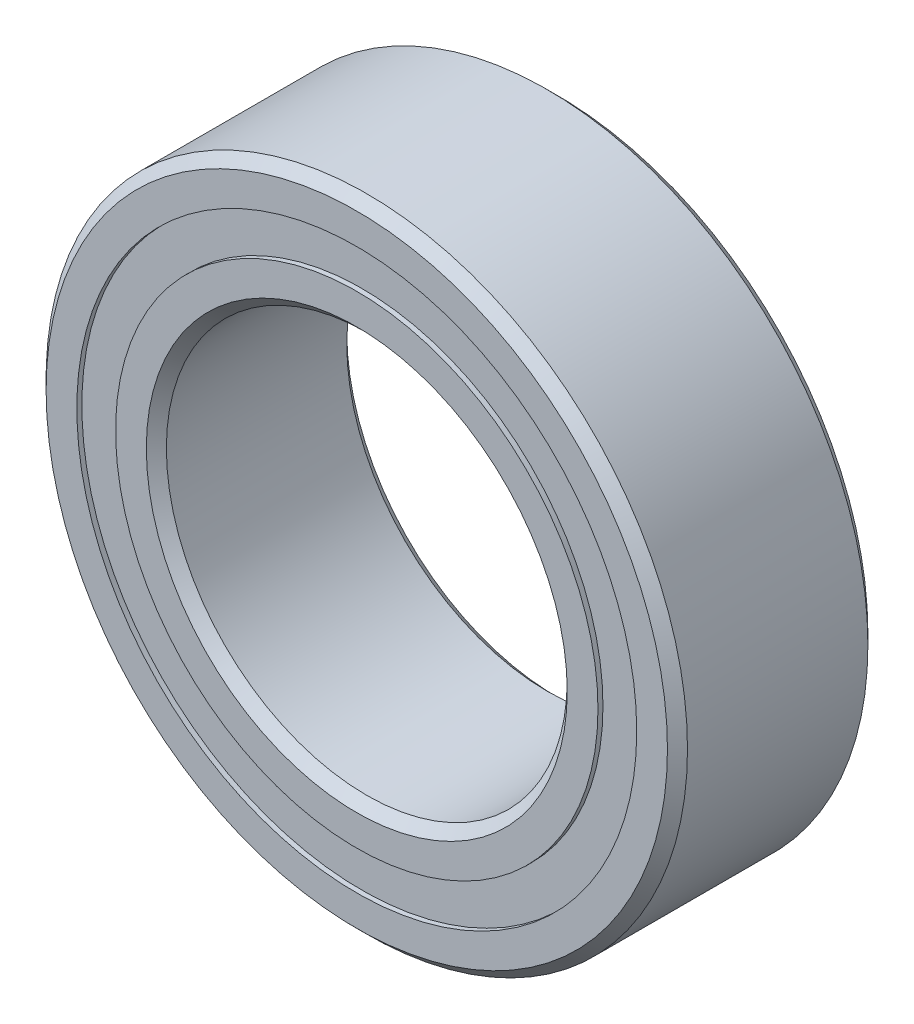
ISO-10303-21;
HEADER;
FILE_DESCRIPTION(('STEP AP214'),'2;1');
FILE_NAME('part.step','',(''),(''),'','','');
FILE_SCHEMA(('AUTOMOTIVE_DESIGN { 1 0 10303 214 1 1 1 1 }'));
ENDSEC;
DATA;
#1=APPLICATION_CONTEXT('core data for automotive mechanical design processes');
#2=APPLICATION_PROTOCOL_DEFINITION('international standard','automotive_design',2000,#1);
#3=PRODUCT_CONTEXT('',#1,'mechanical');
#4=PRODUCT('Part','Part','',(#3));
#5=PRODUCT_RELATED_PRODUCT_CATEGORY('part','',(#4));
#6=PRODUCT_DEFINITION_FORMATION('','',#4);
#7=PRODUCT_DEFINITION_CONTEXT('part definition',#1,'design');
#8=PRODUCT_DEFINITION('design','',#6,#7);
#9=PRODUCT_DEFINITION_SHAPE('','',#8);
#10=(LENGTH_UNIT() NAMED_UNIT(*) SI_UNIT(.MILLI.,.METRE.));
#11=(NAMED_UNIT(*) PLANE_ANGLE_UNIT() SI_UNIT($,.RADIAN.));
#12=(NAMED_UNIT(*) SI_UNIT($,.STERADIAN.) SOLID_ANGLE_UNIT());
#13=UNCERTAINTY_MEASURE_WITH_UNIT(LENGTH_MEASURE(1.E-05),#10,'distance_accuracy_value','');
#14=(GEOMETRIC_REPRESENTATION_CONTEXT(3) GLOBAL_UNCERTAINTY_ASSIGNED_CONTEXT((#13)) GLOBAL_UNIT_ASSIGNED_CONTEXT((#10,
#11,#12)) REPRESENTATION_CONTEXT('',''));
#15=CARTESIAN_POINT('',(0.,0.,0.));
#16=DIRECTION('',(0.,0.,1.));
#17=DIRECTION('',(1.,0.,0.));
#18=AXIS2_PLACEMENT_3D('',#15,#16,#17);
#19=CARTESIAN_POINT('',(0.,3.49175824175824,-1.1875));
#20=DIRECTION('',(0.,0.,1.));
#21=DIRECTION('',(1.,0.,0.));
#22=AXIS2_PLACEMENT_3D('',#19,#20,#21);
#23=PLANE('',#22);
#24=CARTESIAN_POINT('',(0.,0.,-1.1875));
#25=DIRECTION('',(0.,0.,1.));
#26=DIRECTION('',(1.,0.,0.));
#27=AXIS2_PLACEMENT_3D('',#24,#25,#26);
#28=CIRCLE('',#27,3.49175824175824);
#29=CARTESIAN_POINT('',(3.49175824175824,0.,-1.1875));
#30=VERTEX_POINT('',#29);
#31=EDGE_CURVE('E66',#30,#30,#28,.T.);
#32=ORIENTED_EDGE('',*,*,#31,.F.);
#33=EDGE_LOOP('',(#32));
#34=FACE_BOUND('',#33,.T.);
#35=CARTESIAN_POINT('',(0.,0.,-1.1875));
#36=DIRECTION('',(0.,0.,1.));
#37=DIRECTION('',(1.,0.,0.));
#38=AXIS2_PLACEMENT_3D('',#35,#36,#37);
#39=CIRCLE('',#38,3.00824175824176);
#40=CARTESIAN_POINT('',(3.00824175824176,0.,-1.1875));
#41=VERTEX_POINT('',#40);
#42=EDGE_CURVE('E11',#41,#41,#39,.T.);
#43=ORIENTED_EDGE('',*,*,#42,.T.);
#44=EDGE_LOOP('',(#43));
#45=FACE_BOUND('',#44,.T.);
#46=ADVANCED_FACE('F52',(#34,#45),#23,.F.);
#47=CARTESIAN_POINT('',(0.,0.,1.25));
#48=DIRECTION('',(0.,0.,1.));
#49=DIRECTION('',(1.,0.,0.));
#50=AXIS2_PLACEMENT_3D('',#47,#48,#49);
#51=CYLINDRICAL_SURFACE('',#50,3.00824175824176);
#52=ORIENTED_EDGE('',*,*,#42,.F.);
#53=EDGE_LOOP('',(#52));
#54=FACE_BOUND('',#53,.T.);
#55=CARTESIAN_POINT('',(0.,0.,-0.605878719519575));
#56=DIRECTION('',(0.,0.,1.));
#57=DIRECTION('',(1.,0.,0.));
#58=AXIS2_PLACEMENT_3D('',#55,#56,#57);
#59=CIRCLE('',#58,3.00824175824176);
#60=CARTESIAN_POINT('',(3.00824175824176,0.,-0.605878719519575));
#61=VERTEX_POINT('',#60);
#62=EDGE_CURVE('E58',#61,#61,#59,.T.);
#63=ORIENTED_EDGE('',*,*,#62,.T.);
#64=EDGE_LOOP('',(#63));
#65=FACE_BOUND('',#64,.T.);
#66=ADVANCED_FACE('F75',(#54,#65),#51,.F.);
#67=CARTESIAN_POINT('',(0.,3.49175824175824,-0.605878719519575));
#68=DIRECTION('',(0.,0.,-1.));
#69=DIRECTION('',(-1.,0.,0.));
#70=AXIS2_PLACEMENT_3D('',#67,#68,#69);
#71=PLANE('',#70);
#72=ORIENTED_EDGE('',*,*,#62,.F.);
#73=EDGE_LOOP('',(#72));
#74=FACE_BOUND('',#73,.T.);
#75=CARTESIAN_POINT('',(0.,0.,-0.605878719519575));
#76=DIRECTION('',(0.,0.,1.));
#77=DIRECTION('',(1.,0.,0.));
#78=AXIS2_PLACEMENT_3D('',#75,#76,#77);
#79=CIRCLE('',#78,3.49175824175824);
#80=CARTESIAN_POINT('',(3.49175824175824,0.,-0.605878719519575));
#81=VERTEX_POINT('',#80);
#82=EDGE_CURVE('E62',#81,#81,#79,.T.);
#83=ORIENTED_EDGE('',*,*,#82,.T.);
#84=EDGE_LOOP('',(#83));
#85=FACE_BOUND('',#84,.T.);
#86=ADVANCED_FACE('F79',(#74,#85),#71,.F.);
#87=CARTESIAN_POINT('',(0.,0.,1.25));
#88=DIRECTION('',(0.,0.,1.));
#89=DIRECTION('',(1.,0.,0.));
#90=AXIS2_PLACEMENT_3D('',#87,#88,#89);
#91=CYLINDRICAL_SURFACE('',#90,3.49175824175824);
#92=ORIENTED_EDGE('',*,*,#82,.F.);
#93=EDGE_LOOP('',(#92));
#94=FACE_BOUND('',#93,.T.);
#95=ORIENTED_EDGE('',*,*,#31,.T.);
#96=EDGE_LOOP('',(#95));
#97=FACE_BOUND('',#96,.T.);
#98=ADVANCED_FACE('F72',(#94,#97),#91,.T.);
#99=CLOSED_SHELL('',(#46,#66,#86,#98));
#100=MANIFOLD_SOLID_BREP('B2',#99);
#101=CARTESIAN_POINT('',(0.,3.49175824175824,1.1875));
#102=DIRECTION('',(0.,0.,-1.));
#103=DIRECTION('',(-1.,0.,0.));
#104=AXIS2_PLACEMENT_3D('',#101,#102,#103);
#105=PLANE('',#104);
#106=CARTESIAN_POINT('',(0.,0.,1.1875));
#107=DIRECTION('',(0.,0.,1.));
#108=DIRECTION('',(1.,0.,0.));
#109=AXIS2_PLACEMENT_3D('',#106,#107,#108);
#110=CIRCLE('',#109,3.00824175824176);
#111=CARTESIAN_POINT('',(3.00824175824176,0.,1.1875));
#112=VERTEX_POINT('',#111);
#113=EDGE_CURVE('E51',#112,#112,#110,.T.);
#114=ORIENTED_EDGE('',*,*,#113,.F.);
#115=EDGE_LOOP('',(#114));
#116=FACE_BOUND('',#115,.T.);
#117=CARTESIAN_POINT('',(0.,0.,1.1875));
#118=DIRECTION('',(0.,0.,1.));
#119=DIRECTION('',(1.,0.,0.));
#120=AXIS2_PLACEMENT_3D('',#117,#118,#119);
#121=CIRCLE('',#120,3.49175824175824);
#122=CARTESIAN_POINT('',(3.49175824175824,0.,1.1875));
#123=VERTEX_POINT('',#122);
#124=EDGE_CURVE('E126',#123,#123,#121,.T.);
#125=ORIENTED_EDGE('',*,*,#124,.T.);
#126=EDGE_LOOP('',(#125));
#127=FACE_BOUND('',#126,.T.);
#128=ADVANCED_FACE('F112',(#116,#127),#105,.F.);
#129=CARTESIAN_POINT('',(0.,0.,1.25));
#130=DIRECTION('',(0.,0.,1.));
#131=DIRECTION('',(1.,0.,0.));
#132=AXIS2_PLACEMENT_3D('',#129,#130,#131);
#133=CYLINDRICAL_SURFACE('',#132,3.00824175824176);
#134=CARTESIAN_POINT('',(0.,0.,0.605878719519573));
#135=DIRECTION('',(0.,0.,1.));
#136=DIRECTION('',(1.,0.,0.));
#137=AXIS2_PLACEMENT_3D('',#134,#135,#136);
#138=CIRCLE('',#137,3.00824175824176);
#139=CARTESIAN_POINT('',(3.00824175824176,0.,0.605878719519573));
#140=VERTEX_POINT('',#139);
#141=EDGE_CURVE('E118',#140,#140,#138,.T.);
#142=ORIENTED_EDGE('',*,*,#141,.F.);
#143=EDGE_LOOP('',(#142));
#144=FACE_BOUND('',#143,.T.);
#145=ORIENTED_EDGE('',*,*,#113,.T.);
#146=EDGE_LOOP('',(#145));
#147=FACE_BOUND('',#146,.T.);
#148=ADVANCED_FACE('F141',(#144,#147),#133,.F.);
#149=CARTESIAN_POINT('',(0.,3.49175824175824,0.605878719519573));
#150=DIRECTION('',(0.,0.,1.));
#151=DIRECTION('',(1.,0.,0.));
#152=AXIS2_PLACEMENT_3D('',#149,#150,#151);
#153=PLANE('',#152);
#154=CARTESIAN_POINT('',(0.,0.,0.605878719519573));
#155=DIRECTION('',(0.,0.,1.));
#156=DIRECTION('',(1.,0.,0.));
#157=AXIS2_PLACEMENT_3D('',#154,#155,#156);
#158=CIRCLE('',#157,3.49175824175824);
#159=CARTESIAN_POINT('',(3.49175824175824,0.,0.605878719519573));
#160=VERTEX_POINT('',#159);
#161=EDGE_CURVE('E122',#160,#160,#158,.T.);
#162=ORIENTED_EDGE('',*,*,#161,.F.);
#163=EDGE_LOOP('',(#162));
#164=FACE_BOUND('',#163,.T.);
#165=ORIENTED_EDGE('',*,*,#141,.T.);
#166=EDGE_LOOP('',(#165));
#167=FACE_BOUND('',#166,.T.);
#168=ADVANCED_FACE('F136',(#164,#167),#153,.F.);
#169=CARTESIAN_POINT('',(0.,0.,1.25));
#170=DIRECTION('',(0.,0.,1.));
#171=DIRECTION('',(1.,0.,0.));
#172=AXIS2_PLACEMENT_3D('',#169,#170,#171);
#173=CYLINDRICAL_SURFACE('',#172,3.49175824175824);
#174=ORIENTED_EDGE('',*,*,#124,.F.);
#175=EDGE_LOOP('',(#174));
#176=FACE_BOUND('',#175,.T.);
#177=ORIENTED_EDGE('',*,*,#161,.T.);
#178=EDGE_LOOP('',(#177));
#179=FACE_BOUND('',#178,.T.);
#180=ADVANCED_FACE('F133',(#176,#179),#173,.T.);
#181=CLOSED_SHELL('',(#128,#148,#168,#180));
#182=MANIFOLD_SOLID_BREP('B6',#181);
#183=CARTESIAN_POINT('',(-1.62499999999996,2.81458256229945,0.));
#184=DIRECTION('',(0.,0.,1.));
#185=DIRECTION('',(-0.499999999999989,0.866025403784445,0.));
#186=AXIS2_PLACEMENT_3D('',#183,#184,#185);
#187=SPHERICAL_SURFACE('',#186,0.605878719519574);
#188=CARTESIAN_POINT('',(-1.62499999999996,2.81458256229945,0.605878719519573));
#189=VERTEX_POINT('',#188);
#190=VERTEX_LOOP('',#189);
#191=FACE_BOUND('',#190,.T.);
#192=ADVANCED_FACE('F172',(#191),#187,.T.);
#193=CLOSED_SHELL('',(#192));
#194=MANIFOLD_SOLID_BREP('B46',#193);
#195=CARTESIAN_POINT('',(-2.81458256229941,1.62500000000003,0.));
#196=DIRECTION('',(0.,0.,1.));
#197=DIRECTION('',(-0.866025403784433,0.50000000000001,0.));
#198=AXIS2_PLACEMENT_3D('',#195,#196,#197);
#199=SPHERICAL_SURFACE('',#198,0.605878719519574);
#200=CARTESIAN_POINT('',(-2.81458256229941,1.62500000000003,0.605878719519573));
#201=VERTEX_POINT('',#200);
#202=VERTEX_LOOP('',#201);
#203=FACE_BOUND('',#202,.T.);
#204=ADVANCED_FACE('F195',(#203),#199,.T.);
#205=CLOSED_SHELL('',(#204));
#206=MANIFOLD_SOLID_BREP('B108',#205);
#207=CARTESIAN_POINT('',(-3.25,0.,0.));
#208=DIRECTION('',(0.,0.,1.));
#209=DIRECTION('',(-1.,0.,0.));
#210=AXIS2_PLACEMENT_3D('',#207,#208,#209);
#211=SPHERICAL_SURFACE('',#210,0.605878719519574);
#212=CARTESIAN_POINT('',(-3.25,0.,0.605878719519573));
#213=VERTEX_POINT('',#212);
#214=VERTEX_LOOP('',#213);
#215=FACE_BOUND('',#214,.T.);
#216=ADVANCED_FACE('F218',(#215),#211,.T.);
#217=CLOSED_SHELL('',(#216));
#218=MANIFOLD_SOLID_BREP('B168',#217);
#219=CARTESIAN_POINT('',(-2.81458256229944,-1.62499999999997,0.));
#220=DIRECTION('',(0.,0.,1.));
#221=DIRECTION('',(-0.866025403784443,-0.499999999999992,0.));
#222=AXIS2_PLACEMENT_3D('',#219,#220,#221);
#223=SPHERICAL_SURFACE('',#222,0.605878719519574);
#224=CARTESIAN_POINT('',(-2.81458256229944,-1.62499999999997,0.605878719519573));
#225=VERTEX_POINT('',#224);
#226=VERTEX_LOOP('',#225);
#227=FACE_BOUND('',#226,.T.);
#228=ADVANCED_FACE('F241',(#227),#223,.T.);
#229=CLOSED_SHELL('',(#228));
#230=MANIFOLD_SOLID_BREP('B191',#229);
#231=CARTESIAN_POINT('',(-1.62500000000002,-2.81458256229941,0.));
#232=DIRECTION('',(0.,0.,1.));
#233=DIRECTION('',(-0.500000000000007,-0.866025403784435,0.));
#234=AXIS2_PLACEMENT_3D('',#231,#232,#233);
#235=SPHERICAL_SURFACE('',#234,0.605878719519574);
#236=CARTESIAN_POINT('',(-1.62500000000002,-2.81458256229941,0.605878719519573));
#237=VERTEX_POINT('',#236);
#238=VERTEX_LOOP('',#237);
#239=FACE_BOUND('',#238,.T.);
#240=ADVANCED_FACE('F264',(#239),#235,.T.);
#241=CLOSED_SHELL('',(#240));
#242=MANIFOLD_SOLID_BREP('B214',#241);
#243=CARTESIAN_POINT('',(0.,-3.25,0.));
#244=DIRECTION('',(0.,0.,1.));
#245=DIRECTION('',(0.,-1.,0.));
#246=AXIS2_PLACEMENT_3D('',#243,#244,#245);
#247=SPHERICAL_SURFACE('',#246,0.605878719519574);
#248=CARTESIAN_POINT('',(0.,-3.25,0.605878719519573));
#249=VERTEX_POINT('',#248);
#250=VERTEX_LOOP('',#249);
#251=FACE_BOUND('',#250,.T.);
#252=ADVANCED_FACE('F287',(#251),#247,.T.);
#253=CLOSED_SHELL('',(#252));
#254=MANIFOLD_SOLID_BREP('B237',#253);
#255=CARTESIAN_POINT('',(1.62499999999998,-2.81458256229944,0.));
#256=DIRECTION('',(0.,0.,1.));
#257=DIRECTION('',(0.499999999999995,-0.866025403784442,0.));
#258=AXIS2_PLACEMENT_3D('',#255,#256,#257);
#259=SPHERICAL_SURFACE('',#258,0.605878719519574);
#260=CARTESIAN_POINT('',(1.62499999999998,-2.81458256229944,0.605878719519573));
#261=VERTEX_POINT('',#260);
#262=VERTEX_LOOP('',#261);
#263=FACE_BOUND('',#262,.T.);
#264=ADVANCED_FACE('F310',(#263),#259,.T.);
#265=CLOSED_SHELL('',(#264));
#266=MANIFOLD_SOLID_BREP('B260',#265);
#267=CARTESIAN_POINT('',(2.81458256229942,-1.62500000000001,0.));
#268=DIRECTION('',(0.,0.,1.));
#269=DIRECTION('',(0.866025403784436,-0.500000000000004,0.));
#270=AXIS2_PLACEMENT_3D('',#267,#268,#269);
#271=SPHERICAL_SURFACE('',#270,0.605878719519574);
#272=CARTESIAN_POINT('',(2.81458256229942,-1.62500000000001,0.605878719519573));
#273=VERTEX_POINT('',#272);
#274=VERTEX_LOOP('',#273);
#275=FACE_BOUND('',#274,.T.);
#276=ADVANCED_FACE('F333',(#275),#271,.T.);
#277=CLOSED_SHELL('',(#276));
#278=MANIFOLD_SOLID_BREP('B283',#277);
#279=CARTESIAN_POINT('',(3.25,0.,0.));
#280=DIRECTION('',(0.,0.,1.));
#281=DIRECTION('',(1.,0.,0.));
#282=AXIS2_PLACEMENT_3D('',#279,#280,#281);
#283=SPHERICAL_SURFACE('',#282,0.605878719519574);
#284=CARTESIAN_POINT('',(3.25,0.,0.605878719519573));
#285=VERTEX_POINT('',#284);
#286=VERTEX_LOOP('',#285);
#287=FACE_BOUND('',#286,.T.);
#288=ADVANCED_FACE('F356',(#287),#283,.T.);
#289=CLOSED_SHELL('',(#288));
#290=MANIFOLD_SOLID_BREP('B306',#289);
#291=CARTESIAN_POINT('',(2.81458256229943,1.62499999999999,0.));
#292=DIRECTION('',(0.,0.,1.));
#293=DIRECTION('',(0.86602540378444,0.499999999999998,0.));
#294=AXIS2_PLACEMENT_3D('',#291,#292,#293);
#295=SPHERICAL_SURFACE('',#294,0.605878719519574);
#296=CARTESIAN_POINT('',(2.81458256229943,1.62499999999999,0.605878719519573));
#297=VERTEX_POINT('',#296);
#298=VERTEX_LOOP('',#297);
#299=FACE_BOUND('',#298,.T.);
#300=ADVANCED_FACE('F379',(#299),#295,.T.);
#301=CLOSED_SHELL('',(#300));
#302=MANIFOLD_SOLID_BREP('B329',#301);
#303=CARTESIAN_POINT('',(1.625,2.81458256229942,0.));
#304=DIRECTION('',(0.,0.,1.));
#305=DIRECTION('',(0.500000000000001,0.866025403784438,0.));
#306=AXIS2_PLACEMENT_3D('',#303,#304,#305);
#307=SPHERICAL_SURFACE('',#306,0.605878719519574);
#308=CARTESIAN_POINT('',(1.625,2.81458256229942,0.605878719519573));
#309=VERTEX_POINT('',#308);
#310=VERTEX_LOOP('',#309);
#311=FACE_BOUND('',#310,.T.);
#312=ADVANCED_FACE('F402',(#311),#307,.T.);
#313=CLOSED_SHELL('',(#312));
#314=MANIFOLD_SOLID_BREP('B352',#313);
#315=CARTESIAN_POINT('',(0.,3.25,0.));
#316=DIRECTION('',(0.,0.,1.));
#317=DIRECTION('',(0.,1.,0.));
#318=AXIS2_PLACEMENT_3D('',#315,#316,#317);
#319=SPHERICAL_SURFACE('',#318,0.605878719519574);
#320=CARTESIAN_POINT('',(0.,3.25,0.605878719519573));
#321=VERTEX_POINT('',#320);
#322=VERTEX_LOOP('',#321);
#323=FACE_BOUND('',#322,.T.);
#324=ADVANCED_FACE('F427',(#323),#319,.T.);
#325=CLOSED_SHELL('',(#324));
#326=MANIFOLD_SOLID_BREP('B375',#325);
#327=CARTESIAN_POINT('',(0.,3.00824175824176,1.25));
#328=DIRECTION('',(0.,0.,-1.));
#329=DIRECTION('',(-1.,0.,0.));
#330=AXIS2_PLACEMENT_3D('',#327,#328,#329);
#331=PLANE('',#330);
#332=CARTESIAN_POINT('',(0.,0.,1.25));
#333=DIRECTION('',(0.,0.,1.));
#334=DIRECTION('',(1.,0.,0.));
#335=AXIS2_PLACEMENT_3D('',#332,#333,#334);
#336=CIRCLE('',#335,2.625);
#337=CARTESIAN_POINT('',(2.625,0.,1.25));
#338=VERTEX_POINT('',#337);
#339=EDGE_CURVE('E473',#338,#338,#336,.T.);
#340=ORIENTED_EDGE('',*,*,#339,.F.);
#341=EDGE_LOOP('',(#340));
#342=FACE_BOUND('',#341,.T.);
#343=CARTESIAN_POINT('',(0.,0.,1.25));
#344=DIRECTION('',(0.,0.,1.));
#345=DIRECTION('',(1.,0.,0.));
#346=AXIS2_PLACEMENT_3D('',#343,#344,#345);
#347=CIRCLE('',#346,3.00824175824176);
#348=CARTESIAN_POINT('',(3.00824175824176,0.,1.25));
#349=VERTEX_POINT('',#348);
#350=EDGE_CURVE('E426',#349,#349,#347,.T.);
#351=ORIENTED_EDGE('',*,*,#350,.T.);
#352=EDGE_LOOP('',(#351));
#353=FACE_BOUND('',#352,.T.);
#354=ADVANCED_FACE('F445',(#342,#353),#331,.F.);
#355=CARTESIAN_POINT('',(0.,0.,1.25));
#356=DIRECTION('',(0.,0.,1.));
#357=DIRECTION('',(1.,0.,0.));
#358=AXIS2_PLACEMENT_3D('',#355,#356,#357);
#359=CYLINDRICAL_SURFACE('',#358,3.00824175824176);
#360=ORIENTED_EDGE('',*,*,#350,.F.);
#361=EDGE_LOOP('',(#360));
#362=FACE_BOUND('',#361,.T.);
#363=CARTESIAN_POINT('',(0.,0.,0.555555555555555));
#364=DIRECTION('',(0.,0.,1.));
#365=DIRECTION('',(1.,0.,0.));
#366=AXIS2_PLACEMENT_3D('',#363,#364,#365);
#367=CIRCLE('',#366,3.00824175824176);
#368=CARTESIAN_POINT('',(3.00824175824176,0.,0.555555555555555));
#369=VERTEX_POINT('',#368);
#370=EDGE_CURVE('E451',#369,#369,#367,.T.);
#371=ORIENTED_EDGE('',*,*,#370,.T.);
#372=EDGE_LOOP('',(#371));
#373=FACE_BOUND('',#372,.T.);
#374=ADVANCED_FACE('F480',(#362,#373),#359,.T.);
#375=CARTESIAN_POINT('',(0.,0.,0.));
#376=DIRECTION('',(0.,0.,1.));
#377=DIRECTION('',(1.,0.,0.));
#378=AXIS2_PLACEMENT_3D('',#375,#376,#377);
#379=TOROIDAL_SURFACE('',#378,3.25,0.605878719519573);
#380=ORIENTED_EDGE('',*,*,#370,.F.);
#381=EDGE_LOOP('',(#380));
#382=FACE_BOUND('',#381,.T.);
#383=CARTESIAN_POINT('',(0.,0.,-0.555555555555557));
#384=DIRECTION('',(0.,0.,1.));
#385=DIRECTION('',(1.,0.,0.));
#386=AXIS2_PLACEMENT_3D('',#383,#384,#385);
#387=CIRCLE('',#386,3.00824175824176);
#388=CARTESIAN_POINT('',(3.00824175824176,0.,-0.555555555555557));
#389=VERTEX_POINT('',#388);
#390=EDGE_CURVE('E455',#389,#389,#387,.T.);
#391=ORIENTED_EDGE('',*,*,#390,.T.);
#392=EDGE_LOOP('',(#391));
#393=FACE_BOUND('',#392,.T.);
#394=ADVANCED_FACE('F484',(#382,#393),#379,.F.);
#395=CARTESIAN_POINT('',(0.,0.,1.25));
#396=DIRECTION('',(0.,0.,1.));
#397=DIRECTION('',(1.,0.,0.));
#398=AXIS2_PLACEMENT_3D('',#395,#396,#397);
#399=CYLINDRICAL_SURFACE('',#398,3.00824175824176);
#400=ORIENTED_EDGE('',*,*,#390,.F.);
#401=EDGE_LOOP('',(#400));
#402=FACE_BOUND('',#401,.T.);
#403=CARTESIAN_POINT('',(0.,0.,-1.25));
#404=DIRECTION('',(0.,0.,1.));
#405=DIRECTION('',(1.,0.,0.));
#406=AXIS2_PLACEMENT_3D('',#403,#404,#405);
#407=CIRCLE('',#406,3.00824175824176);
#408=CARTESIAN_POINT('',(3.00824175824176,0.,-1.25));
#409=VERTEX_POINT('',#408);
#410=EDGE_CURVE('E459',#409,#409,#407,.T.);
#411=ORIENTED_EDGE('',*,*,#410,.T.);
#412=EDGE_LOOP('',(#411));
#413=FACE_BOUND('',#412,.T.);
#414=ADVANCED_FACE('F489',(#402,#413),#399,.T.);
#415=CARTESIAN_POINT('',(0.,2.625,-1.25));
#416=DIRECTION('',(0.,0.,1.));
#417=DIRECTION('',(1.,0.,0.));
#418=AXIS2_PLACEMENT_3D('',#415,#416,#417);
#419=PLANE('',#418);
#420=ORIENTED_EDGE('',*,*,#410,.F.);
#421=EDGE_LOOP('',(#420));
#422=FACE_BOUND('',#421,.T.);
#423=CARTESIAN_POINT('',(0.,0.,-1.25));
#424=DIRECTION('',(0.,0.,1.));
#425=DIRECTION('',(1.,0.,0.));
#426=AXIS2_PLACEMENT_3D('',#423,#424,#425);
#427=CIRCLE('',#426,2.625);
#428=CARTESIAN_POINT('',(2.625,0.,-1.25));
#429=VERTEX_POINT('',#428);
#430=EDGE_CURVE('E464',#429,#429,#427,.T.);
#431=ORIENTED_EDGE('',*,*,#430,.T.);
#432=EDGE_LOOP('',(#431));
#433=FACE_BOUND('',#432,.T.);
#434=ADVANCED_FACE('F495',(#422,#433),#419,.F.);
#435=CARTESIAN_POINT('',(0.,0.,-1.125));
#436=DIRECTION('',(0.,0.,-1.));
#437=DIRECTION('',(-1.,0.,0.));
#438=AXIS2_PLACEMENT_3D('',#435,#436,#437);
#439=CONICAL_SURFACE('',#438,2.5,0.78539816339745);
#440=ORIENTED_EDGE('',*,*,#430,.F.);
#441=EDGE_LOOP('',(#440));
#442=FACE_BOUND('',#441,.T.);
#443=CARTESIAN_POINT('',(0.,0.,-1.125));
#444=DIRECTION('',(0.,0.,1.));
#445=DIRECTION('',(1.,0.,0.));
#446=AXIS2_PLACEMENT_3D('',#443,#444,#445);
#447=CIRCLE('',#446,2.5);
#448=CARTESIAN_POINT('',(2.5,0.,-1.125));
#449=VERTEX_POINT('',#448);
#450=EDGE_CURVE('E467',#449,#449,#447,.T.);
#451=ORIENTED_EDGE('',*,*,#450,.T.);
#452=EDGE_LOOP('',(#451));
#453=FACE_BOUND('',#452,.T.);
#454=ADVANCED_FACE('F499',(#442,#453),#439,.F.);
#455=CARTESIAN_POINT('',(0.,0.,1.25));
#456=DIRECTION('',(0.,0.,1.));
#457=DIRECTION('',(1.,0.,0.));
#458=AXIS2_PLACEMENT_3D('',#455,#456,#457);
#459=CYLINDRICAL_SURFACE('',#458,2.5);
#460=ORIENTED_EDGE('',*,*,#450,.F.);
#461=EDGE_LOOP('',(#460));
#462=FACE_BOUND('',#461,.T.);
#463=CARTESIAN_POINT('',(0.,0.,1.125));
#464=DIRECTION('',(0.,0.,1.));
#465=DIRECTION('',(1.,0.,0.));
#466=AXIS2_PLACEMENT_3D('',#463,#464,#465);
#467=CIRCLE('',#466,2.5);
#468=CARTESIAN_POINT('',(2.5,0.,1.125));
#469=VERTEX_POINT('',#468);
#470=EDGE_CURVE('E470',#469,#469,#467,.T.);
#471=ORIENTED_EDGE('',*,*,#470,.T.);
#472=EDGE_LOOP('',(#471));
#473=FACE_BOUND('',#472,.T.);
#474=ADVANCED_FACE('F503',(#462,#473),#459,.F.);
#475=CARTESIAN_POINT('',(0.,0.,1.25));
#476=DIRECTION('',(0.,0.,1.));
#477=DIRECTION('',(1.,0.,0.));
#478=AXIS2_PLACEMENT_3D('',#475,#476,#477);
#479=CONICAL_SURFACE('',#478,2.625,0.785398163397447);
#480=ORIENTED_EDGE('',*,*,#470,.F.);
#481=EDGE_LOOP('',(#480));
#482=FACE_BOUND('',#481,.T.);
#483=ORIENTED_EDGE('',*,*,#339,.T.);
#484=EDGE_LOOP('',(#483));
#485=FACE_BOUND('',#484,.T.);
#486=ADVANCED_FACE('F477',(#482,#485),#479,.F.);
#487=CLOSED_SHELL('',(#354,#374,#394,#414,#434,#454,#474,#486));
#488=MANIFOLD_SOLID_BREP('B398',#487);
#489=CARTESIAN_POINT('',(0.,0.,1.125));
#490=DIRECTION('',(0.,0.,-1.));
#491=DIRECTION('',(-1.,0.,0.));
#492=AXIS2_PLACEMENT_3D('',#489,#490,#491);
#493=CONICAL_SURFACE('',#492,4.,0.785398163397451);
#494=CARTESIAN_POINT('',(0.,0.,1.25));
#495=DIRECTION('',(0.,0.,1.));
#496=DIRECTION('',(1.,0.,0.));
#497=AXIS2_PLACEMENT_3D('',#494,#495,#496);
#498=CIRCLE('',#497,3.875);
#499=CARTESIAN_POINT('',(3.875,0.,1.25));
#500=VERTEX_POINT('',#499);
#501=EDGE_CURVE('E579',#500,#500,#498,.T.);
#502=ORIENTED_EDGE('',*,*,#501,.F.);
#503=EDGE_LOOP('',(#502));
#504=FACE_BOUND('',#503,.T.);
#505=CARTESIAN_POINT('',(0.,0.,1.125));
#506=DIRECTION('',(0.,0.,1.));
#507=DIRECTION('',(1.,0.,0.));
#508=AXIS2_PLACEMENT_3D('',#505,#506,#507);
#509=CIRCLE('',#508,4.);
#510=CARTESIAN_POINT('',(4.,0.,1.125));
#511=VERTEX_POINT('',#510);
#512=EDGE_CURVE('E444',#511,#511,#509,.T.);
#513=ORIENTED_EDGE('',*,*,#512,.T.);
#514=EDGE_LOOP('',(#513));
#515=FACE_BOUND('',#514,.T.);
#516=ADVANCED_FACE('F551',(#504,#515),#493,.T.);
#517=CARTESIAN_POINT('',(0.,0.,1.25));
#518=DIRECTION('',(0.,0.,1.));
#519=DIRECTION('',(1.,0.,0.));
#520=AXIS2_PLACEMENT_3D('',#517,#518,#519);
#521=CYLINDRICAL_SURFACE('',#520,4.);
#522=ORIENTED_EDGE('',*,*,#512,.F.);
#523=EDGE_LOOP('',(#522));
#524=FACE_BOUND('',#523,.T.);
#525=CARTESIAN_POINT('',(0.,0.,-1.125));
#526=DIRECTION('',(0.,0.,1.));
#527=DIRECTION('',(1.,0.,0.));
#528=AXIS2_PLACEMENT_3D('',#525,#526,#527);
#529=CIRCLE('',#528,4.);
#530=CARTESIAN_POINT('',(4.,0.,-1.125));
#531=VERTEX_POINT('',#530);
#532=EDGE_CURVE('E557',#531,#531,#529,.T.);
#533=ORIENTED_EDGE('',*,*,#532,.T.);
#534=EDGE_LOOP('',(#533));
#535=FACE_BOUND('',#534,.T.);
#536=ADVANCED_FACE('F586',(#524,#535),#521,.T.);
#537=CARTESIAN_POINT('',(0.,0.,-1.25));
#538=DIRECTION('',(0.,0.,1.));
#539=DIRECTION('',(1.,0.,0.));
#540=AXIS2_PLACEMENT_3D('',#537,#538,#539);
#541=CONICAL_SURFACE('',#540,3.875,0.78539816339745);
#542=ORIENTED_EDGE('',*,*,#532,.F.);
#543=EDGE_LOOP('',(#542));
#544=FACE_BOUND('',#543,.T.);
#545=CARTESIAN_POINT('',(0.,0.,-1.25));
#546=DIRECTION('',(0.,0.,1.));
#547=DIRECTION('',(1.,0.,0.));
#548=AXIS2_PLACEMENT_3D('',#545,#546,#547);
#549=CIRCLE('',#548,3.875);
#550=CARTESIAN_POINT('',(3.875,0.,-1.25));
#551=VERTEX_POINT('',#550);
#552=EDGE_CURVE('E561',#551,#551,#549,.T.);
#553=ORIENTED_EDGE('',*,*,#552,.T.);
#554=EDGE_LOOP('',(#553));
#555=FACE_BOUND('',#554,.T.);
#556=ADVANCED_FACE('F590',(#544,#555),#541,.T.);
#557=CARTESIAN_POINT('',(0.,3.875,-1.25));
#558=DIRECTION('',(0.,0.,1.));
#559=DIRECTION('',(1.,0.,0.));
#560=AXIS2_PLACEMENT_3D('',#557,#558,#559);
#561=PLANE('',#560);
#562=ORIENTED_EDGE('',*,*,#552,.F.);
#563=EDGE_LOOP('',(#562));
#564=FACE_BOUND('',#563,.T.);
#565=CARTESIAN_POINT('',(0.,0.,-1.25));
#566=DIRECTION('',(0.,0.,1.));
#567=DIRECTION('',(1.,0.,0.));
#568=AXIS2_PLACEMENT_3D('',#565,#566,#567);
#569=CIRCLE('',#568,3.49175824175824);
#570=CARTESIAN_POINT('',(3.49175824175824,0.,-1.25));
#571=VERTEX_POINT('',#570);
#572=EDGE_CURVE('E565',#571,#571,#569,.T.);
#573=ORIENTED_EDGE('',*,*,#572,.T.);
#574=EDGE_LOOP('',(#573));
#575=FACE_BOUND('',#574,.T.);
#576=ADVANCED_FACE('F595',(#564,#575),#561,.F.);
#577=CARTESIAN_POINT('',(0.,0.,1.25));
#578=DIRECTION('',(0.,0.,1.));
#579=DIRECTION('',(1.,0.,0.));
#580=AXIS2_PLACEMENT_3D('',#577,#578,#579);
#581=CYLINDRICAL_SURFACE('',#580,3.49175824175824);
#582=ORIENTED_EDGE('',*,*,#572,.F.);
#583=EDGE_LOOP('',(#582));
#584=FACE_BOUND('',#583,.T.);
#585=CARTESIAN_POINT('',(0.,0.,-0.555555555555556));
#586=DIRECTION('',(0.,0.,1.));
#587=DIRECTION('',(1.,0.,0.));
#588=AXIS2_PLACEMENT_3D('',#585,#586,#587);
#589=CIRCLE('',#588,3.49175824175824);
#590=CARTESIAN_POINT('',(3.49175824175824,0.,-0.555555555555556));
#591=VERTEX_POINT('',#590);
#592=EDGE_CURVE('E570',#591,#591,#589,.T.);
#593=ORIENTED_EDGE('',*,*,#592,.T.);
#594=EDGE_LOOP('',(#593));
#595=FACE_BOUND('',#594,.T.);
#596=ADVANCED_FACE('F601',(#584,#595),#581,.F.);
#597=CARTESIAN_POINT('',(0.,0.,0.));
#598=DIRECTION('',(0.,0.,1.));
#599=DIRECTION('',(1.,0.,0.));
#600=AXIS2_PLACEMENT_3D('',#597,#598,#599);
#601=TOROIDAL_SURFACE('',#600,3.25,0.605878719519574);
#602=ORIENTED_EDGE('',*,*,#592,.F.);
#603=EDGE_LOOP('',(#602));
#604=FACE_BOUND('',#603,.T.);
#605=CARTESIAN_POINT('',(0.,0.,0.555555555555555));
#606=DIRECTION('',(0.,0.,1.));
#607=DIRECTION('',(1.,0.,0.));
#608=AXIS2_PLACEMENT_3D('',#605,#606,#607);
#609=CIRCLE('',#608,3.49175824175824);
#610=CARTESIAN_POINT('',(3.49175824175824,0.,0.555555555555555));
#611=VERTEX_POINT('',#610);
#612=EDGE_CURVE('E573',#611,#611,#609,.T.);
#613=ORIENTED_EDGE('',*,*,#612,.T.);
#614=EDGE_LOOP('',(#613));
#615=FACE_BOUND('',#614,.T.);
#616=ADVANCED_FACE('F605',(#604,#615),#601,.F.);
#617=CARTESIAN_POINT('',(0.,0.,1.25));
#618=DIRECTION('',(0.,0.,1.));
#619=DIRECTION('',(1.,0.,0.));
#620=AXIS2_PLACEMENT_3D('',#617,#618,#619);
#621=CYLINDRICAL_SURFACE('',#620,3.49175824175824);
#622=ORIENTED_EDGE('',*,*,#612,.F.);
#623=EDGE_LOOP('',(#622));
#624=FACE_BOUND('',#623,.T.);
#625=CARTESIAN_POINT('',(0.,0.,1.25));
#626=DIRECTION('',(0.,0.,1.));
#627=DIRECTION('',(1.,0.,0.));
#628=AXIS2_PLACEMENT_3D('',#625,#626,#627);
#629=CIRCLE('',#628,3.49175824175824);
#630=CARTESIAN_POINT('',(3.49175824175824,0.,1.25));
#631=VERTEX_POINT('',#630);
#632=EDGE_CURVE('E576',#631,#631,#629,.T.);
#633=ORIENTED_EDGE('',*,*,#632,.T.);
#634=EDGE_LOOP('',(#633));
#635=FACE_BOUND('',#634,.T.);
#636=ADVANCED_FACE('F609',(#624,#635),#621,.F.);
#637=CARTESIAN_POINT('',(0.,3.875,1.25));
#638=DIRECTION('',(0.,0.,-1.));
#639=DIRECTION('',(-1.,0.,0.));
#640=AXIS2_PLACEMENT_3D('',#637,#638,#639);
#641=PLANE('',#640);
#642=ORIENTED_EDGE('',*,*,#632,.F.);
#643=EDGE_LOOP('',(#642));
#644=FACE_BOUND('',#643,.T.);
#645=ORIENTED_EDGE('',*,*,#501,.T.);
#646=EDGE_LOOP('',(#645));
#647=FACE_BOUND('',#646,.T.);
#648=ADVANCED_FACE('F583',(#644,#647),#641,.F.);
#649=CLOSED_SHELL('',(#516,#536,#556,#576,#596,#616,#636,#648));
#650=MANIFOLD_SOLID_BREP('B421',#649);
#651=ADVANCED_BREP_SHAPE_REPRESENTATION('',(#18,#100,#182,#194,#206,#218,#230,#242,#254,#266,
#278,#290,#302,#314,#326,#488,#650),#14);
#652=SHAPE_DEFINITION_REPRESENTATION(#9,#651);
ENDSEC;
END-ISO-10303-21;
